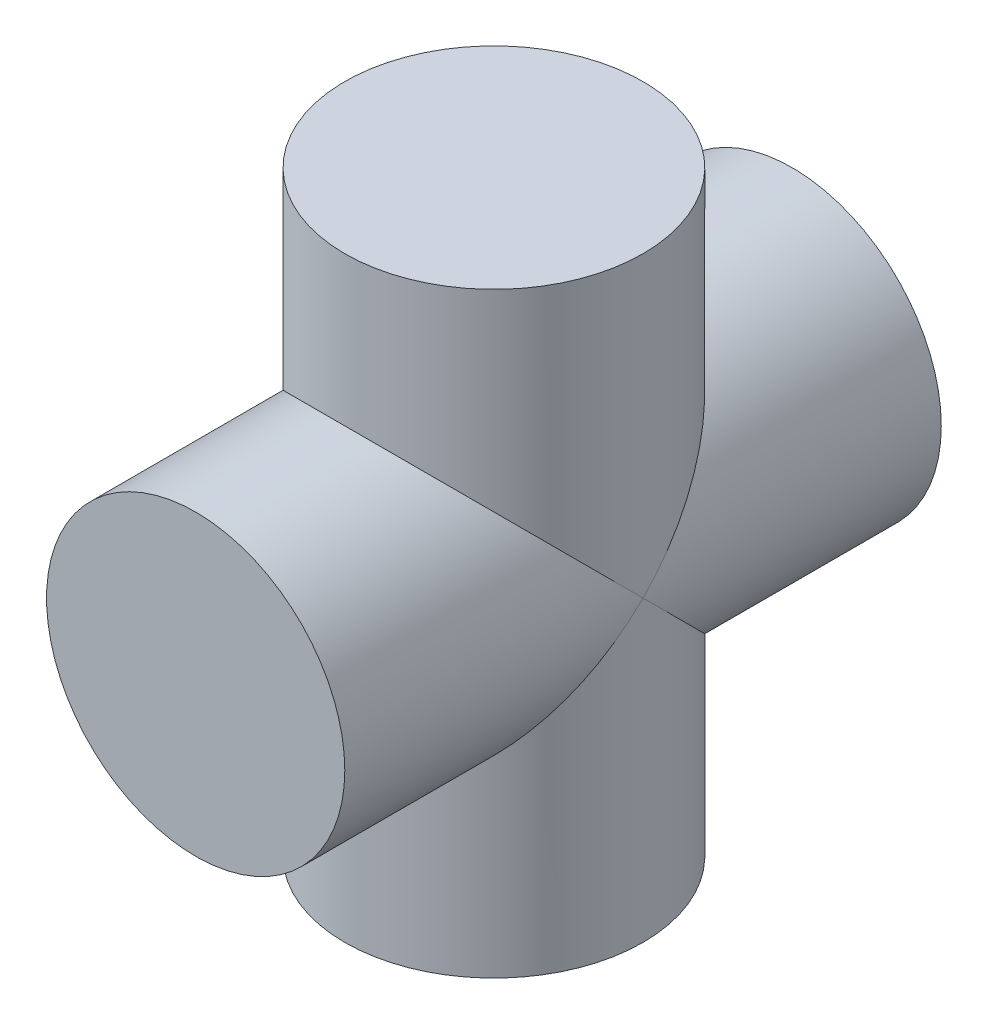
ISO-10303-21;
HEADER;
FILE_DESCRIPTION(('STEP AP214'),'2;1');
FILE_NAME('part.step','',(''),(''),'','','');
FILE_SCHEMA(('AUTOMOTIVE_DESIGN { 1 0 10303 214 1 1 1 1 }'));
ENDSEC;
DATA;
#1=APPLICATION_CONTEXT('core data for automotive mechanical design processes');
#2=APPLICATION_PROTOCOL_DEFINITION('international standard','automotive_design',2000,#1);
#3=PRODUCT_CONTEXT('',#1,'mechanical');
#4=PRODUCT('Part','Part','',(#3));
#5=PRODUCT_RELATED_PRODUCT_CATEGORY('part','',(#4));
#6=PRODUCT_DEFINITION_FORMATION('','',#4);
#7=PRODUCT_DEFINITION_CONTEXT('part definition',#1,'design');
#8=PRODUCT_DEFINITION('design','',#6,#7);
#9=PRODUCT_DEFINITION_SHAPE('','',#8);
#10=(LENGTH_UNIT() NAMED_UNIT(*) SI_UNIT(.MILLI.,.METRE.));
#11=(NAMED_UNIT(*) PLANE_ANGLE_UNIT() SI_UNIT($,.RADIAN.));
#12=(NAMED_UNIT(*) SI_UNIT($,.STERADIAN.) SOLID_ANGLE_UNIT());
#13=UNCERTAINTY_MEASURE_WITH_UNIT(LENGTH_MEASURE(1.E-05),#10,'distance_accuracy_value','');
#14=(GEOMETRIC_REPRESENTATION_CONTEXT(3) GLOBAL_UNCERTAINTY_ASSIGNED_CONTEXT((#13)) GLOBAL_UNIT_ASSIGNED_CONTEXT((#10,
#11,#12)) REPRESENTATION_CONTEXT('',''));
#15=CARTESIAN_POINT('',(0.,0.,0.));
#16=DIRECTION('',(0.,0.,1.));
#17=DIRECTION('',(1.,0.,0.));
#18=AXIS2_PLACEMENT_3D('',#15,#16,#17);
#19=CARTESIAN_POINT('',(0.,0.,10.));
#20=DIRECTION('',(0.,0.,-1.));
#21=DIRECTION('',(-1.,0.,0.));
#22=AXIS2_PLACEMENT_3D('',#19,#20,#21);
#23=CYLINDRICAL_SURFACE('',#22,5.);
#24=CARTESIAN_POINT('',(0.,0.,10.));
#25=DIRECTION('',(0.,0.,1.));
#26=DIRECTION('',(1.,0.,0.));
#27=AXIS2_PLACEMENT_3D('',#24,#25,#26);
#28=CIRCLE('',#27,5.);
#29=CARTESIAN_POINT('',(5.,0.,10.));
#30=VERTEX_POINT('',#29);
#31=EDGE_CURVE('E66',#30,#30,#28,.T.);
#32=ORIENTED_EDGE('',*,*,#31,.F.);
#33=EDGE_LOOP('',(#32));
#34=FACE_BOUND('',#33,.T.);
#35=CARTESIAN_POINT('',(0.,0.,0.));
#36=DIRECTION('',(0.,-0.707106781186547,-0.707106781186547));
#37=DIRECTION('',(0.,0.707106781186547,-0.707106781186547));
#38=AXIS2_PLACEMENT_3D('',#35,#36,#37);
#39=ELLIPSE('',#38,7.07106781186547,5.);
#40=CARTESIAN_POINT('',(5.,0.,0.));
#41=VERTEX_POINT('',#40);
#42=CARTESIAN_POINT('',(-5.,0.,0.));
#43=VERTEX_POINT('',#42);
#44=EDGE_CURVE('E48',#41,#43,#39,.T.);
#45=ORIENTED_EDGE('',*,*,#44,.F.);
#46=CARTESIAN_POINT('',(0.,0.,0.));
#47=DIRECTION('',(0.,0.707106781186547,-0.707106781186547));
#48=DIRECTION('',(0.,-0.707106781186547,-0.707106781186547));
#49=AXIS2_PLACEMENT_3D('',#46,#47,#48);
#50=ELLIPSE('',#49,7.07106781186547,5.);
#51=EDGE_CURVE('E60',#43,#41,#50,.T.);
#52=ORIENTED_EDGE('',*,*,#51,.F.);
#53=EDGE_LOOP('',(#45,#52));
#54=FACE_BOUND('',#53,.T.);
#55=ADVANCED_FACE('F39',(#34,#54),#23,.T.);
#56=CARTESIAN_POINT('',(0.,0.,10.));
#57=DIRECTION('',(0.,0.,1.));
#58=DIRECTION('',(1.,0.,0.));
#59=AXIS2_PLACEMENT_3D('',#56,#57,#58);
#60=PLANE('',#59);
#61=ORIENTED_EDGE('',*,*,#31,.T.);
#62=EDGE_LOOP('',(#61));
#63=FACE_BOUND('',#62,.T.);
#64=ADVANCED_FACE('F90',(#63),#60,.T.);
#65=CARTESIAN_POINT('',(0.,-10.,0.));
#66=DIRECTION('',(0.,1.,0.));
#67=DIRECTION('',(0.,0.,1.));
#68=AXIS2_PLACEMENT_3D('',#65,#66,#67);
#69=PLANE('',#68);
#70=CARTESIAN_POINT('',(0.,-10.,0.));
#71=DIRECTION('',(0.,1.,0.));
#72=DIRECTION('',(0.,0.,1.));
#73=AXIS2_PLACEMENT_3D('',#70,#71,#72);
#74=CIRCLE('',#73,5.);
#75=CARTESIAN_POINT('',(0.,-10.,5.));
#76=VERTEX_POINT('',#75);
#77=EDGE_CURVE('E106',#76,#76,#74,.T.);
#78=ORIENTED_EDGE('',*,*,#77,.F.);
#79=EDGE_LOOP('',(#78));
#80=FACE_BOUND('',#79,.T.);
#81=ADVANCED_FACE('F87',(#80),#69,.F.);
#82=CARTESIAN_POINT('',(0.,10.,0.));
#83=DIRECTION('',(0.,-1.,0.));
#84=DIRECTION('',(0.,0.,-1.));
#85=AXIS2_PLACEMENT_3D('',#82,#83,#84);
#86=CYLINDRICAL_SURFACE('',#85,5.);
#87=ORIENTED_EDGE('',*,*,#77,.T.);
#88=EDGE_LOOP('',(#87));
#89=FACE_BOUND('',#88,.T.);
#90=CARTESIAN_POINT('',(0.,0.,0.));
#91=DIRECTION('',(0.,0.707106781186547,-0.707106781186547));
#92=DIRECTION('',(0.,-0.707106781186547,-0.707106781186547));
#93=AXIS2_PLACEMENT_3D('',#90,#91,#92);
#94=ELLIPSE('',#93,7.07106781186547,5.);
#95=EDGE_CURVE('E54',#43,#41,#94,.F.);
#96=ORIENTED_EDGE('',*,*,#95,.T.);
#97=ORIENTED_EDGE('',*,*,#44,.T.);
#98=EDGE_LOOP('',(#96,#97));
#99=FACE_BOUND('',#98,.T.);
#100=ADVANCED_FACE('F68',(#89,#99),#86,.T.);
#101=CARTESIAN_POINT('',(0.,0.,-10.));
#102=DIRECTION('',(0.,0.,1.));
#103=DIRECTION('',(1.,0.,0.));
#104=AXIS2_PLACEMENT_3D('',#101,#102,#103);
#105=PLANE('',#104);
#106=CARTESIAN_POINT('',(0.,0.,-10.));
#107=DIRECTION('',(0.,0.,1.));
#108=DIRECTION('',(1.,0.,0.));
#109=AXIS2_PLACEMENT_3D('',#106,#107,#108);
#110=CIRCLE('',#109,5.);
#111=CARTESIAN_POINT('',(5.,0.,-10.));
#112=VERTEX_POINT('',#111);
#113=EDGE_CURVE('E99',#112,#112,#110,.T.);
#114=ORIENTED_EDGE('',*,*,#113,.F.);
#115=EDGE_LOOP('',(#114));
#116=FACE_BOUND('',#115,.T.);
#117=ADVANCED_FACE('F81',(#116),#105,.F.);
#118=ORIENTED_EDGE('',*,*,#113,.T.);
#119=EDGE_LOOP('',(#118));
#120=FACE_BOUND('',#119,.T.);
#121=CARTESIAN_POINT('',(0.,0.,0.));
#122=DIRECTION('',(0.,-0.707106781186547,-0.707106781186547));
#123=DIRECTION('',(0.,0.707106781186547,-0.707106781186547));
#124=AXIS2_PLACEMENT_3D('',#121,#122,#123);
#125=ELLIPSE('',#124,7.07106781186547,5.);
#126=EDGE_CURVE('E11',#41,#43,#125,.F.);
#127=ORIENTED_EDGE('',*,*,#126,.F.);
#128=ORIENTED_EDGE('',*,*,#95,.F.);
#129=EDGE_LOOP('',(#127,#128));
#130=FACE_BOUND('',#129,.T.);
#131=ADVANCED_FACE('F41',(#120,#130),#23,.T.);
#132=CARTESIAN_POINT('',(0.,10.,0.));
#133=DIRECTION('',(0.,1.,0.));
#134=DIRECTION('',(0.,0.,1.));
#135=AXIS2_PLACEMENT_3D('',#132,#133,#134);
#136=CIRCLE('',#135,5.);
#137=CARTESIAN_POINT('',(0.,10.,5.));
#138=VERTEX_POINT('',#137);
#139=EDGE_CURVE('E103',#138,#138,#136,.T.);
#140=ORIENTED_EDGE('',*,*,#139,.F.);
#141=EDGE_LOOP('',(#140));
#142=FACE_BOUND('',#141,.T.);
#143=ORIENTED_EDGE('',*,*,#51,.T.);
#144=ORIENTED_EDGE('',*,*,#126,.T.);
#145=EDGE_LOOP('',(#143,#144));
#146=FACE_BOUND('',#145,.T.);
#147=ADVANCED_FACE('F70',(#142,#146),#86,.T.);
#148=CARTESIAN_POINT('',(0.,10.,0.));
#149=DIRECTION('',(0.,1.,0.));
#150=DIRECTION('',(0.,0.,1.));
#151=AXIS2_PLACEMENT_3D('',#148,#149,#150);
#152=PLANE('',#151);
#153=ORIENTED_EDGE('',*,*,#139,.T.);
#154=EDGE_LOOP('',(#153));
#155=FACE_BOUND('',#154,.T.);
#156=ADVANCED_FACE('F72',(#155),#152,.T.);
#157=CLOSED_SHELL('',(#55,#64,#81,#100,#117,#131,#147,#156));
#158=MANIFOLD_SOLID_BREP('B2',#157);
#159=ADVANCED_BREP_SHAPE_REPRESENTATION('',(#18,#158),#14);
#160=SHAPE_DEFINITION_REPRESENTATION(#9,#159);
ENDSEC;
END-ISO-10303-21;
